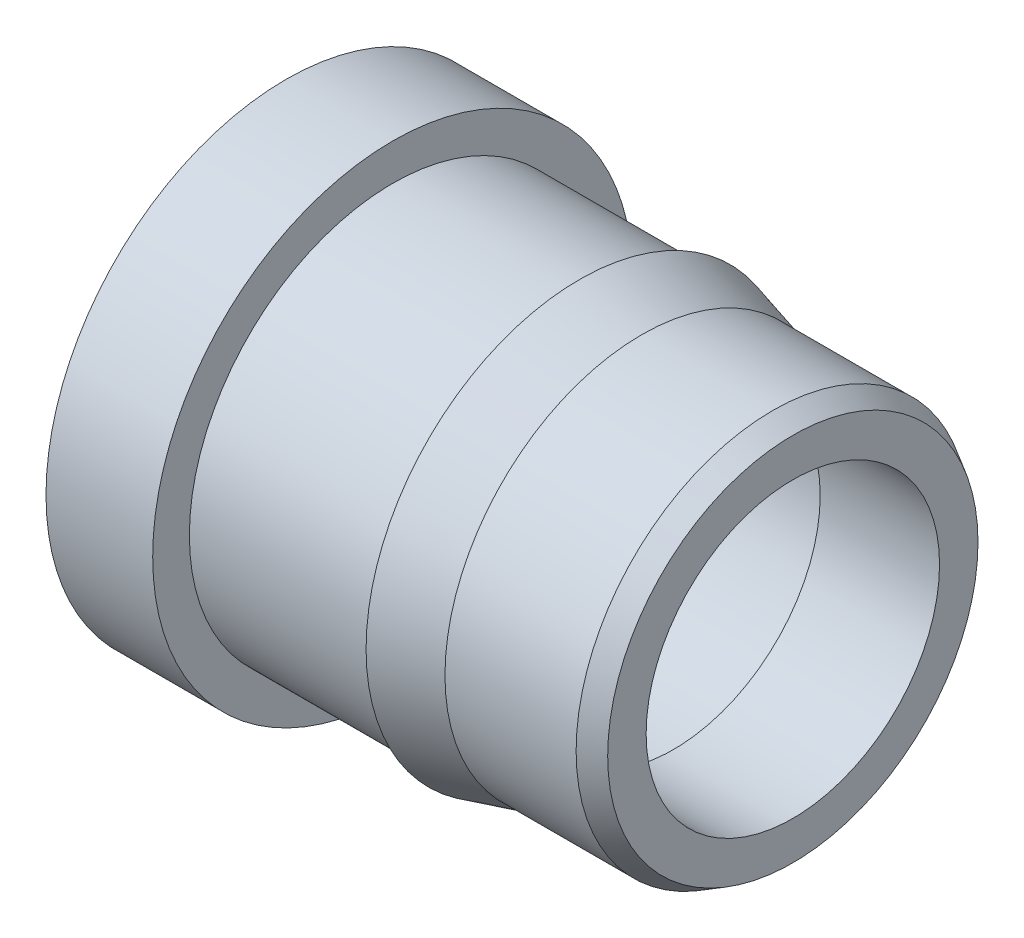
ISO-10303-21;
HEADER;
FILE_DESCRIPTION(('STEP AP214'),'2;1');
FILE_NAME('part.step','',(''),(''),'','','');
FILE_SCHEMA(('AUTOMOTIVE_DESIGN { 1 0 10303 214 1 1 1 1 }'));
ENDSEC;
DATA;
#1=APPLICATION_CONTEXT('core data for automotive mechanical design processes');
#2=APPLICATION_PROTOCOL_DEFINITION('international standard','automotive_design',2000,#1);
#3=PRODUCT_CONTEXT('',#1,'mechanical');
#4=PRODUCT('Part','Part','',(#3));
#5=PRODUCT_RELATED_PRODUCT_CATEGORY('part','',(#4));
#6=PRODUCT_DEFINITION_FORMATION('','',#4);
#7=PRODUCT_DEFINITION_CONTEXT('part definition',#1,'design');
#8=PRODUCT_DEFINITION('design','',#6,#7);
#9=PRODUCT_DEFINITION_SHAPE('','',#8);
#10=(LENGTH_UNIT() NAMED_UNIT(*) SI_UNIT(.MILLI.,.METRE.));
#11=(NAMED_UNIT(*) PLANE_ANGLE_UNIT() SI_UNIT($,.RADIAN.));
#12=(NAMED_UNIT(*) SI_UNIT($,.STERADIAN.) SOLID_ANGLE_UNIT());
#13=UNCERTAINTY_MEASURE_WITH_UNIT(LENGTH_MEASURE(1.E-05),#10,'distance_accuracy_value','');
#14=(GEOMETRIC_REPRESENTATION_CONTEXT(3) GLOBAL_UNCERTAINTY_ASSIGNED_CONTEXT((#13)) GLOBAL_UNIT_ASSIGNED_CONTEXT((#10,
#11,#12)) REPRESENTATION_CONTEXT('',''));
#15=CARTESIAN_POINT('',(0.,0.,0.));
#16=DIRECTION('',(0.,0.,1.));
#17=DIRECTION('',(1.,0.,0.));
#18=AXIS2_PLACEMENT_3D('',#15,#16,#17);
#19=CARTESIAN_POINT('',(1.9304,0.705305909487722,0.));
#20=DIRECTION('',(-1.,0.,0.));
#21=DIRECTION('',(0.,0.,1.));
#22=AXIS2_PLACEMENT_3D('',#19,#20,#21);
#23=PLANE('',#22);
#24=CARTESIAN_POINT('',(1.9304,0.,0.));
#25=DIRECTION('',(1.,0.,0.));
#26=DIRECTION('',(0.,0.,-1.));
#27=AXIS2_PLACEMENT_3D('',#24,#25,#26);
#28=CIRCLE('',#27,0.5588);
#29=CARTESIAN_POINT('',(1.9304,0.,-0.5588));
#30=VERTEX_POINT('',#29);
#31=EDGE_CURVE('E67',#30,#30,#28,.T.);
#32=ORIENTED_EDGE('',*,*,#31,.F.);
#33=EDGE_LOOP('',(#32));
#34=FACE_BOUND('',#33,.T.);
#35=CARTESIAN_POINT('',(1.9304,0.,0.));
#36=DIRECTION('',(-1.,0.,0.));
#37=DIRECTION('',(0.,0.,1.));
#38=AXIS2_PLACEMENT_3D('',#35,#36,#37);
#39=CIRCLE('',#38,0.705305909487722);
#40=CARTESIAN_POINT('',(1.9304,0.,0.705305909487722));
#41=VERTEX_POINT('',#40);
#42=EDGE_CURVE('E10',#41,#41,#39,.T.);
#43=ORIENTED_EDGE('',*,*,#42,.F.);
#44=EDGE_LOOP('',(#43));
#45=FACE_BOUND('',#44,.T.);
#46=ADVANCED_FACE('F30',(#34,#45),#23,.F.);
#47=CARTESIAN_POINT('',(1.9304,0.,0.));
#48=DIRECTION('',(-1.,0.,0.));
#49=DIRECTION('',(0.,0.,1.));
#50=AXIS2_PLACEMENT_3D('',#47,#48,#49);
#51=CONICAL_SURFACE('',#50,0.705305909487722,0.523598775598397);
#52=CARTESIAN_POINT('',(1.8542,0.,0.));
#53=DIRECTION('',(-1.,0.,0.));
#54=DIRECTION('',(0.,0.,1.));
#55=AXIS2_PLACEMENT_3D('',#52,#53,#54);
#56=CIRCLE('',#55,0.749299999999981);
#57=CARTESIAN_POINT('',(1.8542,0.,0.749299999999981));
#58=VERTEX_POINT('',#57);
#59=EDGE_CURVE('E37',#58,#58,#56,.T.);
#60=ORIENTED_EDGE('',*,*,#59,.F.);
#61=EDGE_LOOP('',(#60));
#62=FACE_BOUND('',#61,.T.);
#63=ORIENTED_EDGE('',*,*,#42,.T.);
#64=EDGE_LOOP('',(#63));
#65=FACE_BOUND('',#64,.T.);
#66=ADVANCED_FACE('F86',(#62,#65),#51,.T.);
#67=CARTESIAN_POINT('',(0.,0.,0.));
#68=DIRECTION('',(-1.,0.,0.));
#69=DIRECTION('',(0.,0.,1.));
#70=AXIS2_PLACEMENT_3D('',#67,#68,#69);
#71=CYLINDRICAL_SURFACE('',#70,0.749299999999981);
#72=CARTESIAN_POINT('',(1.35458522628059,0.,0.));
#73=DIRECTION('',(-1.,0.,0.));
#74=DIRECTION('',(0.,0.,1.));
#75=AXIS2_PLACEMENT_3D('',#72,#73,#74);
#76=CIRCLE('',#75,0.749299999999981);
#77=CARTESIAN_POINT('',(1.35458522628059,0.,0.749299999999981));
#78=VERTEX_POINT('',#77);
#79=EDGE_CURVE('E41',#78,#78,#76,.T.);
#80=ORIENTED_EDGE('',*,*,#79,.F.);
#81=EDGE_LOOP('',(#80));
#82=FACE_BOUND('',#81,.T.);
#83=ORIENTED_EDGE('',*,*,#59,.T.);
#84=EDGE_LOOP('',(#83));
#85=FACE_BOUND('',#84,.T.);
#86=ADVANCED_FACE('F91',(#82,#85),#71,.T.);
#87=CARTESIAN_POINT('',(1.35458522628059,0.,0.));
#88=DIRECTION('',(-1.,0.,0.));
#89=DIRECTION('',(0.,0.,1.));
#90=AXIS2_PLACEMENT_3D('',#87,#88,#89);
#91=CONICAL_SURFACE('',#90,0.749299999999981,0.261799387799376);
#92=CARTESIAN_POINT('',(1.1176,0.,0.));
#93=DIRECTION('',(-1.,0.,0.));
#94=DIRECTION('',(0.,0.,1.));
#95=AXIS2_PLACEMENT_3D('',#92,#93,#94);
#96=CIRCLE('',#95,0.81280000000003);
#97=CARTESIAN_POINT('',(1.1176,0.,0.81280000000003));
#98=VERTEX_POINT('',#97);
#99=EDGE_CURVE('E46',#98,#98,#96,.T.);
#100=ORIENTED_EDGE('',*,*,#99,.F.);
#101=EDGE_LOOP('',(#100));
#102=FACE_BOUND('',#101,.T.);
#103=ORIENTED_EDGE('',*,*,#79,.T.);
#104=EDGE_LOOP('',(#103));
#105=FACE_BOUND('',#104,.T.);
#106=ADVANCED_FACE('F97',(#102,#105),#91,.T.);
#107=CARTESIAN_POINT('',(1.1176,0.774699999999989,0.));
#108=DIRECTION('',(1.,0.,0.));
#109=DIRECTION('',(0.,0.,-1.));
#110=AXIS2_PLACEMENT_3D('',#107,#108,#109);
#111=PLANE('',#110);
#112=CARTESIAN_POINT('',(1.1176,0.,0.));
#113=DIRECTION('',(-1.,0.,0.));
#114=DIRECTION('',(0.,0.,1.));
#115=AXIS2_PLACEMENT_3D('',#112,#113,#114);
#116=CIRCLE('',#115,0.774699999999989);
#117=CARTESIAN_POINT('',(1.1176,0.,0.774699999999989));
#118=VERTEX_POINT('',#117);
#119=EDGE_CURVE('E49',#118,#118,#116,.T.);
#120=ORIENTED_EDGE('',*,*,#119,.F.);
#121=EDGE_LOOP('',(#120));
#122=FACE_BOUND('',#121,.T.);
#123=ORIENTED_EDGE('',*,*,#99,.T.);
#124=EDGE_LOOP('',(#123));
#125=FACE_BOUND('',#124,.T.);
#126=ADVANCED_FACE('F104',(#122,#125),#111,.F.);
#127=CARTESIAN_POINT('',(0.,0.,0.));
#128=DIRECTION('',(-1.,0.,0.));
#129=DIRECTION('',(0.,0.,1.));
#130=AXIS2_PLACEMENT_3D('',#127,#128,#129);
#131=CYLINDRICAL_SURFACE('',#130,0.774699999999989);
#132=CARTESIAN_POINT('',(0.406400000000001,0.,0.));
#133=DIRECTION('',(-1.,0.,0.));
#134=DIRECTION('',(0.,0.,1.));
#135=AXIS2_PLACEMENT_3D('',#132,#133,#134);
#136=CIRCLE('',#135,0.774699999999989);
#137=CARTESIAN_POINT('',(0.406400000000001,0.,0.774699999999989));
#138=VERTEX_POINT('',#137);
#139=EDGE_CURVE('E52',#138,#138,#136,.T.);
#140=ORIENTED_EDGE('',*,*,#139,.F.);
#141=EDGE_LOOP('',(#140));
#142=FACE_BOUND('',#141,.T.);
#143=ORIENTED_EDGE('',*,*,#119,.T.);
#144=EDGE_LOOP('',(#143));
#145=FACE_BOUND('',#144,.T.);
#146=ADVANCED_FACE('F108',(#142,#145),#131,.T.);
#147=CARTESIAN_POINT('',(0.406400000000001,0.914399999999982,0.));
#148=DIRECTION('',(-1.,0.,0.));
#149=DIRECTION('',(0.,0.,1.));
#150=AXIS2_PLACEMENT_3D('',#147,#148,#149);
#151=PLANE('',#150);
#152=CARTESIAN_POINT('',(0.406400000000001,0.,0.));
#153=DIRECTION('',(-1.,0.,0.));
#154=DIRECTION('',(0.,0.,1.));
#155=AXIS2_PLACEMENT_3D('',#152,#153,#154);
#156=CIRCLE('',#155,0.914399999999982);
#157=CARTESIAN_POINT('',(0.406400000000001,0.,0.914399999999982));
#158=VERTEX_POINT('',#157);
#159=EDGE_CURVE('E55',#158,#158,#156,.T.);
#160=ORIENTED_EDGE('',*,*,#159,.F.);
#161=EDGE_LOOP('',(#160));
#162=FACE_BOUND('',#161,.T.);
#163=ORIENTED_EDGE('',*,*,#139,.T.);
#164=EDGE_LOOP('',(#163));
#165=FACE_BOUND('',#164,.T.);
#166=ADVANCED_FACE('F112',(#162,#165),#151,.F.);
#167=CARTESIAN_POINT('',(0.,0.,0.));
#168=DIRECTION('',(-1.,0.,0.));
#169=DIRECTION('',(0.,0.,1.));
#170=AXIS2_PLACEMENT_3D('',#167,#168,#169);
#171=CYLINDRICAL_SURFACE('',#170,0.914399999999982);
#172=CARTESIAN_POINT('',(0.,0.,0.));
#173=DIRECTION('',(-1.,0.,0.));
#174=DIRECTION('',(0.,0.,1.));
#175=AXIS2_PLACEMENT_3D('',#172,#173,#174);
#176=CIRCLE('',#175,0.914399999999982);
#177=CARTESIAN_POINT('',(0.,0.,0.914399999999982));
#178=VERTEX_POINT('',#177);
#179=EDGE_CURVE('E58',#178,#178,#176,.T.);
#180=ORIENTED_EDGE('',*,*,#179,.F.);
#181=EDGE_LOOP('',(#180));
#182=FACE_BOUND('',#181,.T.);
#183=ORIENTED_EDGE('',*,*,#159,.T.);
#184=EDGE_LOOP('',(#183));
#185=FACE_BOUND('',#184,.T.);
#186=ADVANCED_FACE('F116',(#182,#185),#171,.T.);
#187=CARTESIAN_POINT('',(0.,0.,0.));
#188=DIRECTION('',(1.,0.,0.));
#189=DIRECTION('',(0.,0.,-1.));
#190=AXIS2_PLACEMENT_3D('',#187,#188,#189);
#191=PLANE('',#190);
#192=CARTESIAN_POINT('',(0.,0.,0.));
#193=DIRECTION('',(-1.,0.,0.));
#194=DIRECTION('',(0.,0.,1.));
#195=AXIS2_PLACEMENT_3D('',#192,#193,#194);
#196=CIRCLE('',#195,0.647699999999999);
#197=CARTESIAN_POINT('',(0.,0.,0.647699999999999));
#198=VERTEX_POINT('',#197);
#199=EDGE_CURVE('E61',#198,#198,#196,.T.);
#200=ORIENTED_EDGE('',*,*,#199,.F.);
#201=EDGE_LOOP('',(#200));
#202=FACE_BOUND('',#201,.T.);
#203=ORIENTED_EDGE('',*,*,#179,.T.);
#204=EDGE_LOOP('',(#203));
#205=FACE_BOUND('',#204,.T.);
#206=ADVANCED_FACE('F120',(#202,#205),#191,.F.);
#207=CARTESIAN_POINT('',(0.,0.,0.));
#208=DIRECTION('',(-1.,0.,0.));
#209=DIRECTION('',(0.,0.,1.));
#210=AXIS2_PLACEMENT_3D('',#207,#208,#209);
#211=CYLINDRICAL_SURFACE('',#210,0.647699999999999);
#212=CARTESIAN_POINT('',(1.4224,0.,0.));
#213=DIRECTION('',(-1.,0.,0.));
#214=DIRECTION('',(0.,0.,1.));
#215=AXIS2_PLACEMENT_3D('',#212,#213,#214);
#216=CIRCLE('',#215,0.6477);
#217=CARTESIAN_POINT('',(1.4224,0.,0.6477));
#218=VERTEX_POINT('',#217);
#219=EDGE_CURVE('E64',#218,#218,#216,.T.);
#220=ORIENTED_EDGE('',*,*,#219,.F.);
#221=EDGE_LOOP('',(#220));
#222=FACE_BOUND('',#221,.T.);
#223=ORIENTED_EDGE('',*,*,#199,.T.);
#224=EDGE_LOOP('',(#223));
#225=FACE_BOUND('',#224,.T.);
#226=ADVANCED_FACE('F83',(#222,#225),#211,.F.);
#227=CARTESIAN_POINT('',(1.4224,0.,0.));
#228=DIRECTION('',(-1.,0.,0.));
#229=DIRECTION('',(0.,0.,1.));
#230=AXIS2_PLACEMENT_3D('',#227,#228,#229);
#231=CONICAL_SURFACE('',#230,0.6477,1.02974425867666);
#232=CARTESIAN_POINT('',(1.47581650903155,0.,0.));
#233=DIRECTION('',(-1.,0.,0.));
#234=DIRECTION('',(0.,0.,1.));
#235=AXIS2_PLACEMENT_3D('',#232,#233,#234);
#236=CIRCLE('',#235,0.5588);
#237=CARTESIAN_POINT('',(1.47581650903155,0.,0.5588));
#238=VERTEX_POINT('',#237);
#239=EDGE_CURVE('E33',#238,#238,#236,.F.);
#240=ORIENTED_EDGE('',*,*,#239,.T.);
#241=EDGE_LOOP('',(#240));
#242=FACE_BOUND('',#241,.T.);
#243=ORIENTED_EDGE('',*,*,#219,.T.);
#244=EDGE_LOOP('',(#243));
#245=FACE_BOUND('',#244,.T.);
#246=ADVANCED_FACE('F74',(#242,#245),#231,.F.);
#247=CARTESIAN_POINT('',(1.9304,0.,0.));
#248=DIRECTION('',(1.,0.,0.));
#249=DIRECTION('',(0.,0.,-1.));
#250=AXIS2_PLACEMENT_3D('',#247,#248,#249);
#251=CYLINDRICAL_SURFACE('',#250,0.5588);
#252=ORIENTED_EDGE('',*,*,#31,.T.);
#253=EDGE_LOOP('',(#252));
#254=FACE_BOUND('',#253,.T.);
#255=ORIENTED_EDGE('',*,*,#239,.F.);
#256=EDGE_LOOP('',(#255));
#257=FACE_BOUND('',#256,.T.);
#258=ADVANCED_FACE('F77',(#254,#257),#251,.F.);
#259=CLOSED_SHELL('',(#46,#66,#86,#106,#126,#146,#166,#186,#206,#226,#246,#258));
#260=MANIFOLD_SOLID_BREP('B2',#259);
#261=ADVANCED_BREP_SHAPE_REPRESENTATION('',(#18,#260),#14);
#262=SHAPE_DEFINITION_REPRESENTATION(#9,#261);
ENDSEC;
END-ISO-10303-21;
